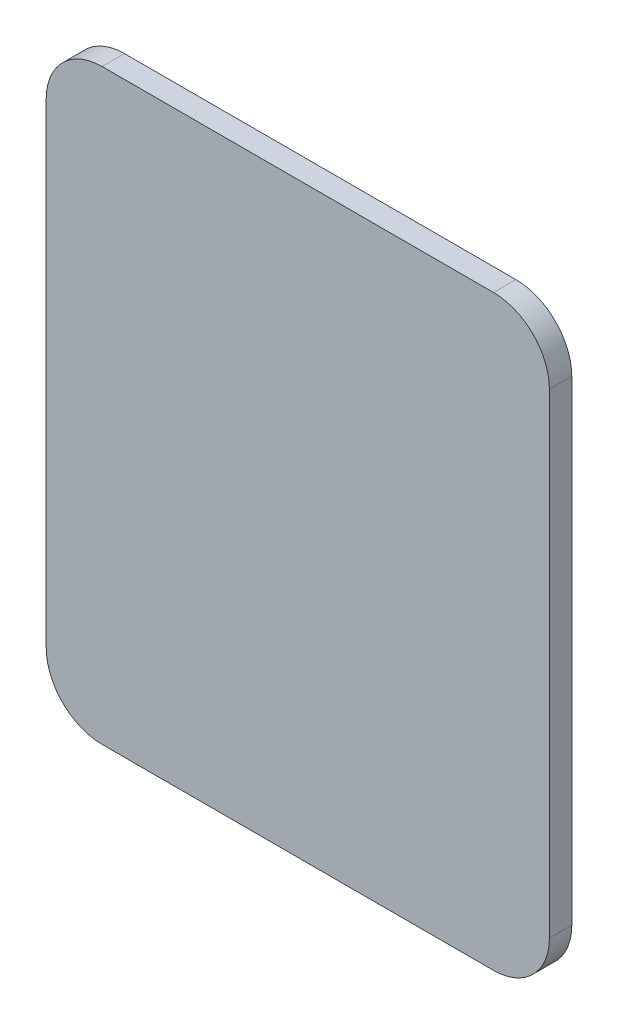
ISO-10303-21;
HEADER;
FILE_DESCRIPTION(('STEP AP214'),'2;1');
FILE_NAME('part.step','',(''),(''),'','','');
FILE_SCHEMA(('AUTOMOTIVE_DESIGN { 1 0 10303 214 1 1 1 1 }'));
ENDSEC;
DATA;
#1=APPLICATION_CONTEXT('core data for automotive mechanical design processes');
#2=APPLICATION_PROTOCOL_DEFINITION('international standard','automotive_design',2000,#1);
#3=PRODUCT_CONTEXT('',#1,'mechanical');
#4=PRODUCT('Part','Part','',(#3));
#5=PRODUCT_RELATED_PRODUCT_CATEGORY('part','',(#4));
#6=PRODUCT_DEFINITION_FORMATION('','',#4);
#7=PRODUCT_DEFINITION_CONTEXT('part definition',#1,'design');
#8=PRODUCT_DEFINITION('design','',#6,#7);
#9=PRODUCT_DEFINITION_SHAPE('','',#8);
#10=(LENGTH_UNIT() NAMED_UNIT(*) SI_UNIT(.MILLI.,.METRE.));
#11=(NAMED_UNIT(*) PLANE_ANGLE_UNIT() SI_UNIT($,.RADIAN.));
#12=(NAMED_UNIT(*) SI_UNIT($,.STERADIAN.) SOLID_ANGLE_UNIT());
#13=UNCERTAINTY_MEASURE_WITH_UNIT(LENGTH_MEASURE(1.E-05),#10,'distance_accuracy_value','');
#14=(GEOMETRIC_REPRESENTATION_CONTEXT(3) GLOBAL_UNCERTAINTY_ASSIGNED_CONTEXT((#13)) GLOBAL_UNIT_ASSIGNED_CONTEXT((#10,
#11,#12)) REPRESENTATION_CONTEXT('',''));
#15=CARTESIAN_POINT('',(0.,0.,0.));
#16=DIRECTION('',(0.,0.,1.));
#17=DIRECTION('',(1.,0.,0.));
#18=AXIS2_PLACEMENT_3D('',#15,#16,#17);
#19=CARTESIAN_POINT('',(9.,-10.5,0.4));
#20=DIRECTION('',(-1.,0.,0.));
#21=DIRECTION('',(0.,0.,1.));
#22=AXIS2_PLACEMENT_3D('',#19,#20,#21);
#23=PLANE('',#22);
#24=DIRECTION('',(0.,1.,0.));
#25=VECTOR('',#24,1.);
#26=CARTESIAN_POINT('',(9.,-10.5,0.4));
#27=LINE('',#26,#25);
#28=CARTESIAN_POINT('',(9.,-8.5,0.4));
#29=VERTEX_POINT('',#28);
#30=CARTESIAN_POINT('',(9.,8.49999999999999,0.4));
#31=VERTEX_POINT('',#30);
#32=EDGE_CURVE('E134',#29,#31,#27,.T.);
#33=ORIENTED_EDGE('',*,*,#32,.F.);
#34=DIRECTION('',(0.,0.,-1.));
#35=VECTOR('',#34,1.);
#36=CARTESIAN_POINT('',(9.,-8.5,0.4));
#37=LINE('',#36,#35);
#38=CARTESIAN_POINT('',(9.,-8.5,-0.4));
#39=VERTEX_POINT('',#38);
#40=EDGE_CURVE('E173',#29,#39,#37,.T.);
#41=ORIENTED_EDGE('',*,*,#40,.T.);
#42=DIRECTION('',(0.,1.,0.));
#43=VECTOR('',#42,1.);
#44=CARTESIAN_POINT('',(9.,-10.5,-0.4));
#45=LINE('',#44,#43);
#46=CARTESIAN_POINT('',(9.,8.49999999999999,-0.4));
#47=VERTEX_POINT('',#46);
#48=EDGE_CURVE('E184',#39,#47,#45,.T.);
#49=ORIENTED_EDGE('',*,*,#48,.T.);
#50=DIRECTION('',(0.,0.,-1.));
#51=VECTOR('',#50,1.);
#52=CARTESIAN_POINT('',(9.,8.5,0.4));
#53=LINE('',#52,#51);
#54=EDGE_CURVE('E170',#47,#31,#53,.F.);
#55=ORIENTED_EDGE('',*,*,#54,.T.);
#56=EDGE_LOOP('',(#33,#41,#49,#55));
#57=FACE_BOUND('',#56,.T.);
#58=ADVANCED_FACE('F39',(#57),#23,.F.);
#59=CARTESIAN_POINT('',(-9.,10.5,0.4));
#60=DIRECTION('',(0.,-1.,0.));
#61=DIRECTION('',(0.,0.,-1.));
#62=AXIS2_PLACEMENT_3D('',#59,#60,#61);
#63=PLANE('',#62);
#64=DIRECTION('',(-1.,0.,0.));
#65=VECTOR('',#64,1.);
#66=CARTESIAN_POINT('',(-9.,10.5,-0.4));
#67=LINE('',#66,#65);
#68=CARTESIAN_POINT('',(7.,10.5,-0.4));
#69=VERTEX_POINT('',#68);
#70=CARTESIAN_POINT('',(-7.,10.5,-0.4));
#71=VERTEX_POINT('',#70);
#72=EDGE_CURVE('E141',#69,#71,#67,.T.);
#73=ORIENTED_EDGE('',*,*,#72,.T.);
#74=DIRECTION('',(0.,0.,-1.));
#75=VECTOR('',#74,1.);
#76=CARTESIAN_POINT('',(-7.,10.5,0.4));
#77=LINE('',#76,#75);
#78=CARTESIAN_POINT('',(-7.,10.5,0.4));
#79=VERTEX_POINT('',#78);
#80=EDGE_CURVE('E11',#71,#79,#77,.F.);
#81=ORIENTED_EDGE('',*,*,#80,.T.);
#82=DIRECTION('',(-1.,0.,0.));
#83=VECTOR('',#82,1.);
#84=CARTESIAN_POINT('',(-9.,10.5,0.4));
#85=LINE('',#84,#83);
#86=CARTESIAN_POINT('',(7.,10.5,0.4));
#87=VERTEX_POINT('',#86);
#88=EDGE_CURVE('E139',#87,#79,#85,.T.);
#89=ORIENTED_EDGE('',*,*,#88,.F.);
#90=DIRECTION('',(0.,0.,-1.));
#91=VECTOR('',#90,1.);
#92=CARTESIAN_POINT('',(7.,10.5,0.4));
#93=LINE('',#92,#91);
#94=EDGE_CURVE('E48',#87,#69,#93,.T.);
#95=ORIENTED_EDGE('',*,*,#94,.T.);
#96=EDGE_LOOP('',(#73,#81,#89,#95));
#97=FACE_BOUND('',#96,.T.);
#98=ADVANCED_FACE('F180',(#97),#63,.F.);
#99=CARTESIAN_POINT('',(-9.,-10.5,0.4));
#100=DIRECTION('',(1.,0.,0.));
#101=DIRECTION('',(0.,0.,-1.));
#102=AXIS2_PLACEMENT_3D('',#99,#100,#101);
#103=PLANE('',#102);
#104=DIRECTION('',(0.,-1.,0.));
#105=VECTOR('',#104,1.);
#106=CARTESIAN_POINT('',(-9.,-10.5,-0.4));
#107=LINE('',#106,#105);
#108=CARTESIAN_POINT('',(-9.,8.49999999999999,-0.4));
#109=VERTEX_POINT('',#108);
#110=CARTESIAN_POINT('',(-9.,-8.5,-0.4));
#111=VERTEX_POINT('',#110);
#112=EDGE_CURVE('E135',#109,#111,#107,.T.);
#113=ORIENTED_EDGE('',*,*,#112,.T.);
#114=DIRECTION('',(0.,0.,-1.));
#115=VECTOR('',#114,1.);
#116=CARTESIAN_POINT('',(-9.,-8.5,0.4));
#117=LINE('',#116,#115);
#118=CARTESIAN_POINT('',(-9.,-8.5,0.4));
#119=VERTEX_POINT('',#118);
#120=EDGE_CURVE('E110',#111,#119,#117,.F.);
#121=ORIENTED_EDGE('',*,*,#120,.T.);
#122=DIRECTION('',(0.,-1.,0.));
#123=VECTOR('',#122,1.);
#124=CARTESIAN_POINT('',(-9.,-10.5,0.4));
#125=LINE('',#124,#123);
#126=CARTESIAN_POINT('',(-9.,8.49999999999999,0.4));
#127=VERTEX_POINT('',#126);
#128=EDGE_CURVE('E190',#127,#119,#125,.T.);
#129=ORIENTED_EDGE('',*,*,#128,.F.);
#130=DIRECTION('',(0.,0.,-1.));
#131=VECTOR('',#130,1.);
#132=CARTESIAN_POINT('',(-9.,8.5,0.4));
#133=LINE('',#132,#131);
#134=EDGE_CURVE('E116',#127,#109,#133,.T.);
#135=ORIENTED_EDGE('',*,*,#134,.T.);
#136=EDGE_LOOP('',(#113,#121,#129,#135));
#137=FACE_BOUND('',#136,.T.);
#138=ADVANCED_FACE('F202',(#137),#103,.F.);
#139=CARTESIAN_POINT('',(-9.,-10.5,0.4));
#140=DIRECTION('',(0.,1.,0.));
#141=DIRECTION('',(0.,0.,1.));
#142=AXIS2_PLACEMENT_3D('',#139,#140,#141);
#143=PLANE('',#142);
#144=DIRECTION('',(1.,0.,0.));
#145=VECTOR('',#144,1.);
#146=CARTESIAN_POINT('',(-9.,-10.5,0.4));
#147=LINE('',#146,#145);
#148=CARTESIAN_POINT('',(-7.,-10.5,0.4));
#149=VERTEX_POINT('',#148);
#150=CARTESIAN_POINT('',(7.,-10.5,0.4));
#151=VERTEX_POINT('',#150);
#152=EDGE_CURVE('E126',#149,#151,#147,.T.);
#153=ORIENTED_EDGE('',*,*,#152,.F.);
#154=DIRECTION('',(0.,0.,-1.));
#155=VECTOR('',#154,1.);
#156=CARTESIAN_POINT('',(-7.,-10.5,0.4));
#157=LINE('',#156,#155);
#158=CARTESIAN_POINT('',(-7.,-10.5,-0.4));
#159=VERTEX_POINT('',#158);
#160=EDGE_CURVE('E109',#149,#159,#157,.T.);
#161=ORIENTED_EDGE('',*,*,#160,.T.);
#162=DIRECTION('',(1.,0.,0.));
#163=VECTOR('',#162,1.);
#164=CARTESIAN_POINT('',(-9.,-10.5,-0.4));
#165=LINE('',#164,#163);
#166=CARTESIAN_POINT('',(7.,-10.5,-0.4));
#167=VERTEX_POINT('',#166);
#168=EDGE_CURVE('E123',#159,#167,#165,.T.);
#169=ORIENTED_EDGE('',*,*,#168,.T.);
#170=DIRECTION('',(0.,0.,-1.));
#171=VECTOR('',#170,1.);
#172=CARTESIAN_POINT('',(7.,-10.5,0.4));
#173=LINE('',#172,#171);
#174=EDGE_CURVE('E129',#167,#151,#173,.F.);
#175=ORIENTED_EDGE('',*,*,#174,.T.);
#176=EDGE_LOOP('',(#153,#161,#169,#175));
#177=FACE_BOUND('',#176,.T.);
#178=ADVANCED_FACE('F122',(#177),#143,.F.);
#179=CARTESIAN_POINT('',(0.,0.,0.4));
#180=DIRECTION('',(0.,0.,-1.));
#181=DIRECTION('',(-1.,0.,0.));
#182=AXIS2_PLACEMENT_3D('',#179,#180,#181);
#183=PLANE('',#182);
#184=ORIENTED_EDGE('',*,*,#128,.T.);
#185=CARTESIAN_POINT('',(-7.,-8.5,0.4));
#186=DIRECTION('',(0.,0.,-1.));
#187=DIRECTION('',(-1.,0.,0.));
#188=AXIS2_PLACEMENT_3D('',#185,#186,#187);
#189=CIRCLE('',#188,2.);
#190=EDGE_CURVE('E167',#119,#149,#189,.F.);
#191=ORIENTED_EDGE('',*,*,#190,.T.);
#192=ORIENTED_EDGE('',*,*,#152,.T.);
#193=CARTESIAN_POINT('',(7.,-8.5,0.4));
#194=DIRECTION('',(0.,0.,-1.));
#195=DIRECTION('',(-1.,0.,0.));
#196=AXIS2_PLACEMENT_3D('',#193,#194,#195);
#197=CIRCLE('',#196,2.);
#198=EDGE_CURVE('E164',#151,#29,#197,.F.);
#199=ORIENTED_EDGE('',*,*,#198,.T.);
#200=ORIENTED_EDGE('',*,*,#32,.T.);
#201=CARTESIAN_POINT('',(7.,8.5,0.4));
#202=DIRECTION('',(0.,0.,-1.));
#203=DIRECTION('',(-1.,0.,0.));
#204=AXIS2_PLACEMENT_3D('',#201,#202,#203);
#205=CIRCLE('',#204,2.);
#206=EDGE_CURVE('E60',#31,#87,#205,.F.);
#207=ORIENTED_EDGE('',*,*,#206,.T.);
#208=ORIENTED_EDGE('',*,*,#88,.T.);
#209=CARTESIAN_POINT('',(-7.,8.5,0.4));
#210=DIRECTION('',(0.,0.,-1.));
#211=DIRECTION('',(-1.,0.,0.));
#212=AXIS2_PLACEMENT_3D('',#209,#210,#211);
#213=CIRCLE('',#212,2.);
#214=EDGE_CURVE('E161',#79,#127,#213,.F.);
#215=ORIENTED_EDGE('',*,*,#214,.T.);
#216=EDGE_LOOP('',(#184,#191,#192,#199,#200,#207,#208,#215));
#217=FACE_BOUND('',#216,.T.);
#218=ADVANCED_FACE('F196',(#217),#183,.F.);
#219=CARTESIAN_POINT('',(0.,0.,-0.4));
#220=DIRECTION('',(0.,0.,-1.));
#221=DIRECTION('',(-1.,0.,0.));
#222=AXIS2_PLACEMENT_3D('',#219,#220,#221);
#223=PLANE('',#222);
#224=ORIENTED_EDGE('',*,*,#168,.F.);
#225=CARTESIAN_POINT('',(-7.,-8.5,-0.4));
#226=DIRECTION('',(0.,0.,-1.));
#227=DIRECTION('',(-1.,0.,0.));
#228=AXIS2_PLACEMENT_3D('',#225,#226,#227);
#229=CIRCLE('',#228,2.);
#230=EDGE_CURVE('E105',#159,#111,#229,.T.);
#231=ORIENTED_EDGE('',*,*,#230,.T.);
#232=ORIENTED_EDGE('',*,*,#112,.F.);
#233=CARTESIAN_POINT('',(-7.,8.5,-0.4));
#234=DIRECTION('',(0.,0.,-1.));
#235=DIRECTION('',(-1.,0.,0.));
#236=AXIS2_PLACEMENT_3D('',#233,#234,#235);
#237=CIRCLE('',#236,2.);
#238=EDGE_CURVE('E149',#109,#71,#237,.T.);
#239=ORIENTED_EDGE('',*,*,#238,.T.);
#240=ORIENTED_EDGE('',*,*,#72,.F.);
#241=CARTESIAN_POINT('',(7.,8.5,-0.4));
#242=DIRECTION('',(0.,0.,-1.));
#243=DIRECTION('',(-1.,0.,0.));
#244=AXIS2_PLACEMENT_3D('',#241,#242,#243);
#245=CIRCLE('',#244,2.);
#246=EDGE_CURVE('E128',#69,#47,#245,.T.);
#247=ORIENTED_EDGE('',*,*,#246,.T.);
#248=ORIENTED_EDGE('',*,*,#48,.F.);
#249=CARTESIAN_POINT('',(7.,-8.5,-0.4));
#250=DIRECTION('',(0.,0.,-1.));
#251=DIRECTION('',(-1.,0.,0.));
#252=AXIS2_PLACEMENT_3D('',#249,#250,#251);
#253=CIRCLE('',#252,2.);
#254=EDGE_CURVE('E117',#39,#167,#253,.T.);
#255=ORIENTED_EDGE('',*,*,#254,.T.);
#256=EDGE_LOOP('',(#224,#231,#232,#239,#240,#247,#248,#255));
#257=FACE_BOUND('',#256,.T.);
#258=ADVANCED_FACE('F131',(#257),#223,.T.);
#259=CARTESIAN_POINT('',(-7.,-8.5,0.4));
#260=DIRECTION('',(0.,0.,-1.));
#261=DIRECTION('',(-1.,0.,0.));
#262=AXIS2_PLACEMENT_3D('',#259,#260,#261);
#263=CYLINDRICAL_SURFACE('',#262,2.);
#264=ORIENTED_EDGE('',*,*,#190,.F.);
#265=ORIENTED_EDGE('',*,*,#120,.F.);
#266=ORIENTED_EDGE('',*,*,#230,.F.);
#267=ORIENTED_EDGE('',*,*,#160,.F.);
#268=EDGE_LOOP('',(#264,#265,#266,#267));
#269=FACE_BOUND('',#268,.T.);
#270=ADVANCED_FACE('F108',(#269),#263,.T.);
#271=CARTESIAN_POINT('',(7.,-8.5,0.4));
#272=DIRECTION('',(0.,0.,-1.));
#273=DIRECTION('',(-1.,0.,0.));
#274=AXIS2_PLACEMENT_3D('',#271,#272,#273);
#275=CYLINDRICAL_SURFACE('',#274,2.);
#276=ORIENTED_EDGE('',*,*,#198,.F.);
#277=ORIENTED_EDGE('',*,*,#174,.F.);
#278=ORIENTED_EDGE('',*,*,#254,.F.);
#279=ORIENTED_EDGE('',*,*,#40,.F.);
#280=EDGE_LOOP('',(#276,#277,#278,#279));
#281=FACE_BOUND('',#280,.T.);
#282=ADVANCED_FACE('F207',(#281),#275,.T.);
#283=CARTESIAN_POINT('',(-7.,8.5,0.4));
#284=DIRECTION('',(0.,0.,-1.));
#285=DIRECTION('',(-1.,0.,0.));
#286=AXIS2_PLACEMENT_3D('',#283,#284,#285);
#287=CYLINDRICAL_SURFACE('',#286,2.);
#288=ORIENTED_EDGE('',*,*,#214,.F.);
#289=ORIENTED_EDGE('',*,*,#80,.F.);
#290=ORIENTED_EDGE('',*,*,#238,.F.);
#291=ORIENTED_EDGE('',*,*,#134,.F.);
#292=EDGE_LOOP('',(#288,#289,#290,#291));
#293=FACE_BOUND('',#292,.T.);
#294=ADVANCED_FACE('F200',(#293),#287,.T.);
#295=CARTESIAN_POINT('',(7.,8.5,0.4));
#296=DIRECTION('',(0.,0.,-1.));
#297=DIRECTION('',(-1.,0.,0.));
#298=AXIS2_PLACEMENT_3D('',#295,#296,#297);
#299=CYLINDRICAL_SURFACE('',#298,2.);
#300=ORIENTED_EDGE('',*,*,#206,.F.);
#301=ORIENTED_EDGE('',*,*,#54,.F.);
#302=ORIENTED_EDGE('',*,*,#246,.F.);
#303=ORIENTED_EDGE('',*,*,#94,.F.);
#304=EDGE_LOOP('',(#300,#301,#302,#303));
#305=FACE_BOUND('',#304,.T.);
#306=ADVANCED_FACE('F41',(#305),#299,.T.);
#307=CLOSED_SHELL('',(#58,#98,#138,#178,#218,#258,#270,#282,#294,#306));
#308=MANIFOLD_SOLID_BREP('B2',#307);
#309=ADVANCED_BREP_SHAPE_REPRESENTATION('',(#18,#308),#14);
#310=SHAPE_DEFINITION_REPRESENTATION(#9,#309);
ENDSEC;
END-ISO-10303-21;
